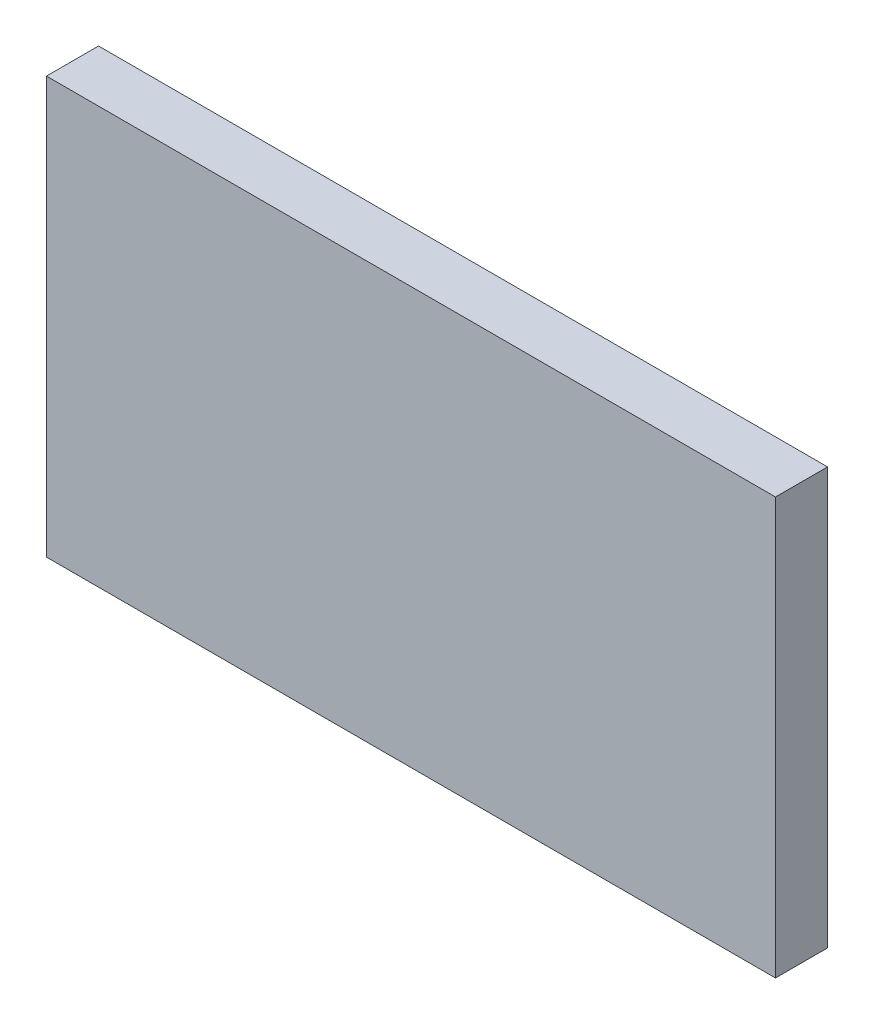
ISO-10303-21;
HEADER;
FILE_DESCRIPTION(('STEP AP214'),'2;1');
FILE_NAME('part.step','',(''),(''),'','','');
FILE_SCHEMA(('AUTOMOTIVE_DESIGN { 1 0 10303 214 1 1 1 1 }'));
ENDSEC;
DATA;
#1=APPLICATION_CONTEXT('core data for automotive mechanical design processes');
#2=APPLICATION_PROTOCOL_DEFINITION('international standard','automotive_design',2000,#1);
#3=PRODUCT_CONTEXT('',#1,'mechanical');
#4=PRODUCT('Part','Part','',(#3));
#5=PRODUCT_RELATED_PRODUCT_CATEGORY('part','',(#4));
#6=PRODUCT_DEFINITION_FORMATION('','',#4);
#7=PRODUCT_DEFINITION_CONTEXT('part definition',#1,'design');
#8=PRODUCT_DEFINITION('design','',#6,#7);
#9=PRODUCT_DEFINITION_SHAPE('','',#8);
#10=(LENGTH_UNIT() NAMED_UNIT(*) SI_UNIT(.MILLI.,.METRE.));
#11=(NAMED_UNIT(*) PLANE_ANGLE_UNIT() SI_UNIT($,.RADIAN.));
#12=(NAMED_UNIT(*) SI_UNIT($,.STERADIAN.) SOLID_ANGLE_UNIT());
#13=UNCERTAINTY_MEASURE_WITH_UNIT(LENGTH_MEASURE(1.E-05),#10,'distance_accuracy_value','');
#14=(GEOMETRIC_REPRESENTATION_CONTEXT(3) GLOBAL_UNCERTAINTY_ASSIGNED_CONTEXT((#13)) GLOBAL_UNIT_ASSIGNED_CONTEXT((#10,
#11,#12)) REPRESENTATION_CONTEXT('',''));
#15=CARTESIAN_POINT('',(0.,0.,0.));
#16=DIRECTION('',(0.,0.,1.));
#17=DIRECTION('',(1.,0.,0.));
#18=AXIS2_PLACEMENT_3D('',#15,#16,#17);
#19=CARTESIAN_POINT('',(-0.7,-1.,0.));
#20=DIRECTION('',(1.,0.,0.));
#21=DIRECTION('',(0.,0.,1.));
#22=AXIS2_PLACEMENT_3D('',#19,#20,#21);
#23=PLANE('',#22);
#24=DIRECTION('',(0.,1.,0.));
#25=VECTOR('',#24,1.);
#26=CARTESIAN_POINT('',(-0.7,-1.,0.1));
#27=LINE('',#26,#25);
#28=CARTESIAN_POINT('',(-0.7,-1.,0.1));
#29=VERTEX_POINT('',#28);
#30=CARTESIAN_POINT('',(-0.7,-0.2,0.1));
#31=VERTEX_POINT('',#30);
#32=EDGE_CURVE('E11',#29,#31,#27,.T.);
#33=ORIENTED_EDGE('',*,*,#32,.T.);
#34=DIRECTION('',(0.,0.,1.));
#35=VECTOR('',#34,1.);
#36=CARTESIAN_POINT('',(-0.7,-0.2,0.));
#37=LINE('',#36,#35);
#38=CARTESIAN_POINT('',(-0.7,-0.2,0.));
#39=VERTEX_POINT('',#38);
#40=EDGE_CURVE('E24',#39,#31,#37,.T.);
#41=ORIENTED_EDGE('',*,*,#40,.F.);
#42=DIRECTION('',(0.,1.,0.));
#43=VECTOR('',#42,1.);
#44=CARTESIAN_POINT('',(-0.7,-1.,0.));
#45=LINE('',#44,#43);
#46=CARTESIAN_POINT('',(-0.7,-1.,0.));
#47=VERTEX_POINT('',#46);
#48=EDGE_CURVE('E86',#47,#39,#45,.T.);
#49=ORIENTED_EDGE('',*,*,#48,.F.);
#50=DIRECTION('',(0.,0.,1.));
#51=VECTOR('',#50,1.);
#52=CARTESIAN_POINT('',(-0.7,-1.,0.));
#53=LINE('',#52,#51);
#54=EDGE_CURVE('E36',#47,#29,#53,.T.);
#55=ORIENTED_EDGE('',*,*,#54,.T.);
#56=EDGE_LOOP('',(#33,#41,#49,#55));
#57=FACE_BOUND('',#56,.T.);
#58=ADVANCED_FACE('F17',(#57),#23,.F.);
#59=CARTESIAN_POINT('',(0.7,-1.,0.));
#60=DIRECTION('',(1.,0.,0.));
#61=DIRECTION('',(0.,0.,1.));
#62=AXIS2_PLACEMENT_3D('',#59,#60,#61);
#63=PLANE('',#62);
#64=DIRECTION('',(0.,0.,1.));
#65=VECTOR('',#64,1.);
#66=CARTESIAN_POINT('',(0.7,-1.,0.));
#67=LINE('',#66,#65);
#68=CARTESIAN_POINT('',(0.7,-1.,0.));
#69=VERTEX_POINT('',#68);
#70=CARTESIAN_POINT('',(0.7,-1.,0.1));
#71=VERTEX_POINT('',#70);
#72=EDGE_CURVE('E83',#69,#71,#67,.T.);
#73=ORIENTED_EDGE('',*,*,#72,.F.);
#74=DIRECTION('',(0.,1.,0.));
#75=VECTOR('',#74,1.);
#76=CARTESIAN_POINT('',(0.7,-1.,0.));
#77=LINE('',#76,#75);
#78=CARTESIAN_POINT('',(0.7,-0.2,0.));
#79=VERTEX_POINT('',#78);
#80=EDGE_CURVE('E63',#69,#79,#77,.T.);
#81=ORIENTED_EDGE('',*,*,#80,.T.);
#82=DIRECTION('',(0.,0.,1.));
#83=VECTOR('',#82,1.);
#84=CARTESIAN_POINT('',(0.7,-0.2,0.));
#85=LINE('',#84,#83);
#86=CARTESIAN_POINT('',(0.7,-0.2,0.1));
#87=VERTEX_POINT('',#86);
#88=EDGE_CURVE('E57',#79,#87,#85,.T.);
#89=ORIENTED_EDGE('',*,*,#88,.T.);
#90=DIRECTION('',(0.,1.,0.));
#91=VECTOR('',#90,1.);
#92=CARTESIAN_POINT('',(0.7,-1.,0.1));
#93=LINE('',#92,#91);
#94=EDGE_CURVE('E60',#71,#87,#93,.T.);
#95=ORIENTED_EDGE('',*,*,#94,.F.);
#96=EDGE_LOOP('',(#73,#81,#89,#95));
#97=FACE_BOUND('',#96,.T.);
#98=ADVANCED_FACE('F59',(#97),#63,.T.);
#99=CARTESIAN_POINT('',(-0.7,-1.,0.));
#100=DIRECTION('',(0.,1.,0.));
#101=DIRECTION('',(0.,0.,1.));
#102=AXIS2_PLACEMENT_3D('',#99,#100,#101);
#103=PLANE('',#102);
#104=ORIENTED_EDGE('',*,*,#72,.T.);
#105=DIRECTION('',(1.,0.,0.));
#106=VECTOR('',#105,1.);
#107=CARTESIAN_POINT('',(-0.7,-1.,0.1));
#108=LINE('',#107,#106);
#109=EDGE_CURVE('E71',#29,#71,#108,.T.);
#110=ORIENTED_EDGE('',*,*,#109,.F.);
#111=ORIENTED_EDGE('',*,*,#54,.F.);
#112=DIRECTION('',(1.,0.,0.));
#113=VECTOR('',#112,1.);
#114=CARTESIAN_POINT('',(-0.7,-1.,0.));
#115=LINE('',#114,#113);
#116=EDGE_CURVE('E76',#47,#69,#115,.T.);
#117=ORIENTED_EDGE('',*,*,#116,.T.);
#118=EDGE_LOOP('',(#104,#110,#111,#117));
#119=FACE_BOUND('',#118,.T.);
#120=ADVANCED_FACE('F91',(#119),#103,.F.);
#121=CARTESIAN_POINT('',(-0.7,-0.2,0.));
#122=DIRECTION('',(0.,1.,0.));
#123=DIRECTION('',(0.,0.,1.));
#124=AXIS2_PLACEMENT_3D('',#121,#122,#123);
#125=PLANE('',#124);
#126=DIRECTION('',(1.,0.,0.));
#127=VECTOR('',#126,1.);
#128=CARTESIAN_POINT('',(-0.7,-0.2,0.));
#129=LINE('',#128,#127);
#130=EDGE_CURVE('E74',#39,#79,#129,.T.);
#131=ORIENTED_EDGE('',*,*,#130,.F.);
#132=ORIENTED_EDGE('',*,*,#40,.T.);
#133=DIRECTION('',(1.,0.,0.));
#134=VECTOR('',#133,1.);
#135=CARTESIAN_POINT('',(-0.7,-0.2,0.1));
#136=LINE('',#135,#134);
#137=EDGE_CURVE('E69',#31,#87,#136,.T.);
#138=ORIENTED_EDGE('',*,*,#137,.T.);
#139=ORIENTED_EDGE('',*,*,#88,.F.);
#140=EDGE_LOOP('',(#131,#132,#138,#139));
#141=FACE_BOUND('',#140,.T.);
#142=ADVANCED_FACE('F73',(#141),#125,.T.);
#143=CARTESIAN_POINT('',(-0.7,-1.,0.));
#144=DIRECTION('',(0.,0.,1.));
#145=DIRECTION('',(1.,0.,0.));
#146=AXIS2_PLACEMENT_3D('',#143,#144,#145);
#147=PLANE('',#146);
#148=ORIENTED_EDGE('',*,*,#130,.T.);
#149=ORIENTED_EDGE('',*,*,#80,.F.);
#150=ORIENTED_EDGE('',*,*,#116,.F.);
#151=ORIENTED_EDGE('',*,*,#48,.T.);
#152=EDGE_LOOP('',(#148,#149,#150,#151));
#153=FACE_BOUND('',#152,.T.);
#154=ADVANCED_FACE('F89',(#153),#147,.F.);
#155=CARTESIAN_POINT('',(-0.7,-1.,0.1));
#156=DIRECTION('',(0.,0.,1.));
#157=DIRECTION('',(1.,0.,0.));
#158=AXIS2_PLACEMENT_3D('',#155,#156,#157);
#159=PLANE('',#158);
#160=ORIENTED_EDGE('',*,*,#32,.F.);
#161=ORIENTED_EDGE('',*,*,#109,.T.);
#162=ORIENTED_EDGE('',*,*,#94,.T.);
#163=ORIENTED_EDGE('',*,*,#137,.F.);
#164=EDGE_LOOP('',(#160,#161,#162,#163));
#165=FACE_BOUND('',#164,.T.);
#166=ADVANCED_FACE('F68',(#165),#159,.T.);
#167=CLOSED_SHELL('',(#58,#98,#120,#142,#154,#166));
#168=MANIFOLD_SOLID_BREP('B1',#167);
#169=ADVANCED_BREP_SHAPE_REPRESENTATION('',(#18,#168),#14);
#170=SHAPE_DEFINITION_REPRESENTATION(#9,#169);
ENDSEC;
END-ISO-10303-21;
